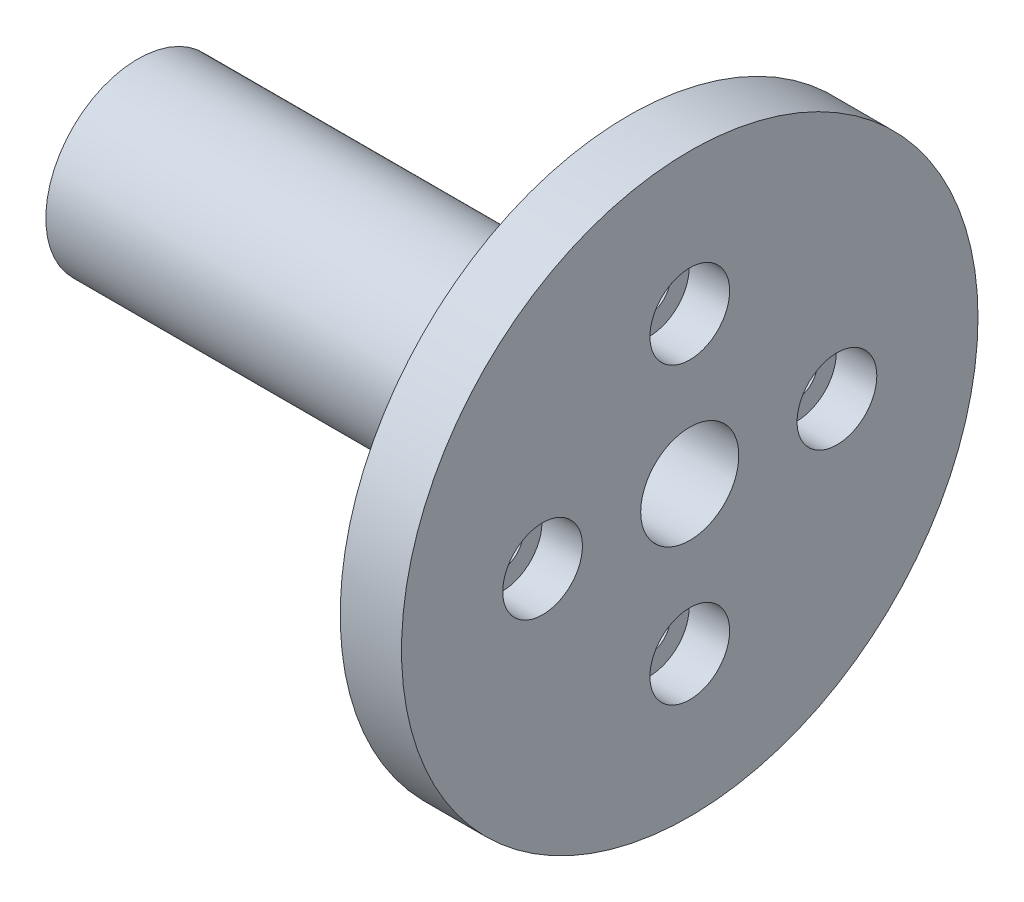
ISO-10303-21;
HEADER;
FILE_DESCRIPTION(('STEP AP214'),'2;1');
FILE_NAME('part.step','',(''),(''),'','','');
FILE_SCHEMA(('AUTOMOTIVE_DESIGN { 1 0 10303 214 1 1 1 1 }'));
ENDSEC;
DATA;
#1=APPLICATION_CONTEXT('core data for automotive mechanical design processes');
#2=APPLICATION_PROTOCOL_DEFINITION('international standard','automotive_design',2000,#1);
#3=PRODUCT_CONTEXT('',#1,'mechanical');
#4=PRODUCT('Part','Part','',(#3));
#5=PRODUCT_RELATED_PRODUCT_CATEGORY('part','',(#4));
#6=PRODUCT_DEFINITION_FORMATION('','',#4);
#7=PRODUCT_DEFINITION_CONTEXT('part definition',#1,'design');
#8=PRODUCT_DEFINITION('design','',#6,#7);
#9=PRODUCT_DEFINITION_SHAPE('','',#8);
#10=(LENGTH_UNIT() NAMED_UNIT(*) SI_UNIT(.MILLI.,.METRE.));
#11=(NAMED_UNIT(*) PLANE_ANGLE_UNIT() SI_UNIT($,.RADIAN.));
#12=(NAMED_UNIT(*) SI_UNIT($,.STERADIAN.) SOLID_ANGLE_UNIT());
#13=UNCERTAINTY_MEASURE_WITH_UNIT(LENGTH_MEASURE(1.E-05),#10,'distance_accuracy_value','');
#14=(GEOMETRIC_REPRESENTATION_CONTEXT(3) GLOBAL_UNCERTAINTY_ASSIGNED_CONTEXT((#13)) GLOBAL_UNIT_ASSIGNED_CONTEXT((#10,
#11,#12)) REPRESENTATION_CONTEXT('',''));
#15=CARTESIAN_POINT('',(0.,0.,0.));
#16=DIRECTION('',(0.,0.,1.));
#17=DIRECTION('',(1.,0.,0.));
#18=AXIS2_PLACEMENT_3D('',#15,#16,#17);
#19=CARTESIAN_POINT('',(0.,0.,-4.5));
#20=DIRECTION('',(-1.,0.,0.));
#21=DIRECTION('',(0.,0.,1.));
#22=AXIS2_PLACEMENT_3D('',#19,#20,#21);
#23=CYLINDRICAL_SURFACE('',#22,1.7);
#24=CARTESIAN_POINT('',(-5.,0.,-4.5));
#25=DIRECTION('',(-1.,0.,0.));
#26=DIRECTION('',(0.,0.,1.));
#27=AXIS2_PLACEMENT_3D('',#24,#25,#26);
#28=CIRCLE('',#27,1.7);
#29=CARTESIAN_POINT('',(-5.,0.,-2.8));
#30=VERTEX_POINT('',#29);
#31=EDGE_CURVE('E62',#30,#30,#28,.T.);
#32=ORIENTED_EDGE('',*,*,#31,.T.);
#33=EDGE_LOOP('',(#32));
#34=FACE_BOUND('',#33,.T.);
#35=CARTESIAN_POINT('',(-3.3,0.,-4.5));
#36=DIRECTION('',(1.,0.,0.));
#37=DIRECTION('',(0.,0.,-1.));
#38=AXIS2_PLACEMENT_3D('',#35,#36,#37);
#39=CIRCLE('',#38,1.7);
#40=CARTESIAN_POINT('',(-3.3,0.,-6.2));
#41=VERTEX_POINT('',#40);
#42=EDGE_CURVE('E38',#41,#41,#39,.F.);
#43=ORIENTED_EDGE('',*,*,#42,.F.);
#44=EDGE_LOOP('',(#43));
#45=FACE_BOUND('',#44,.T.);
#46=ADVANCED_FACE('F34',(#34,#45),#23,.F.);
#47=CARTESIAN_POINT('',(0.,-12.,7.5));
#48=DIRECTION('',(-1.,0.,0.));
#49=DIRECTION('',(0.,0.,1.));
#50=AXIS2_PLACEMENT_3D('',#47,#48,#49);
#51=CYLINDRICAL_SURFACE('',#50,1.7);
#52=CARTESIAN_POINT('',(-5.,-12.,7.5));
#53=DIRECTION('',(-1.,0.,0.));
#54=DIRECTION('',(0.,0.,1.));
#55=AXIS2_PLACEMENT_3D('',#52,#53,#54);
#56=CIRCLE('',#55,1.7);
#57=CARTESIAN_POINT('',(-5.,-12.,9.2));
#58=VERTEX_POINT('',#57);
#59=EDGE_CURVE('E66',#58,#58,#56,.T.);
#60=ORIENTED_EDGE('',*,*,#59,.T.);
#61=EDGE_LOOP('',(#60));
#62=FACE_BOUND('',#61,.T.);
#63=CARTESIAN_POINT('',(-3.3,-12.,7.5));
#64=DIRECTION('',(1.,0.,0.));
#65=DIRECTION('',(0.,0.,-1.));
#66=AXIS2_PLACEMENT_3D('',#63,#64,#65);
#67=CIRCLE('',#66,1.7);
#68=CARTESIAN_POINT('',(-3.3,-12.,5.8));
#69=VERTEX_POINT('',#68);
#70=EDGE_CURVE('E57',#69,#69,#67,.F.);
#71=ORIENTED_EDGE('',*,*,#70,.F.);
#72=EDGE_LOOP('',(#71));
#73=FACE_BOUND('',#72,.T.);
#74=ADVANCED_FACE('F100',(#62,#73),#51,.F.);
#75=CARTESIAN_POINT('',(0.,0.,19.5));
#76=DIRECTION('',(-1.,0.,0.));
#77=DIRECTION('',(0.,0.,1.));
#78=AXIS2_PLACEMENT_3D('',#75,#76,#77);
#79=CYLINDRICAL_SURFACE('',#78,1.7);
#80=CARTESIAN_POINT('',(-5.,0.,19.5));
#81=DIRECTION('',(-1.,0.,0.));
#82=DIRECTION('',(0.,0.,1.));
#83=AXIS2_PLACEMENT_3D('',#80,#81,#82);
#84=CIRCLE('',#83,1.7);
#85=CARTESIAN_POINT('',(-5.,0.,21.2));
#86=VERTEX_POINT('',#85);
#87=EDGE_CURVE('E71',#86,#86,#84,.T.);
#88=ORIENTED_EDGE('',*,*,#87,.T.);
#89=EDGE_LOOP('',(#88));
#90=FACE_BOUND('',#89,.T.);
#91=CARTESIAN_POINT('',(-3.3,0.,19.5));
#92=DIRECTION('',(1.,0.,0.));
#93=DIRECTION('',(0.,0.,-1.));
#94=AXIS2_PLACEMENT_3D('',#91,#92,#93);
#95=CIRCLE('',#94,1.7);
#96=CARTESIAN_POINT('',(-3.3,0.,17.8));
#97=VERTEX_POINT('',#96);
#98=EDGE_CURVE('E54',#97,#97,#95,.F.);
#99=ORIENTED_EDGE('',*,*,#98,.F.);
#100=EDGE_LOOP('',(#99));
#101=FACE_BOUND('',#100,.T.);
#102=ADVANCED_FACE('F105',(#90,#101),#79,.F.);
#103=CARTESIAN_POINT('',(0.,12.,7.5));
#104=DIRECTION('',(-1.,0.,0.));
#105=DIRECTION('',(0.,0.,1.));
#106=AXIS2_PLACEMENT_3D('',#103,#104,#105);
#107=CYLINDRICAL_SURFACE('',#106,1.7);
#108=CARTESIAN_POINT('',(-5.,12.,7.5));
#109=DIRECTION('',(-1.,0.,0.));
#110=DIRECTION('',(0.,0.,1.));
#111=AXIS2_PLACEMENT_3D('',#108,#109,#110);
#112=CIRCLE('',#111,1.7);
#113=CARTESIAN_POINT('',(-5.,12.,9.2));
#114=VERTEX_POINT('',#113);
#115=EDGE_CURVE('E77',#114,#114,#112,.T.);
#116=ORIENTED_EDGE('',*,*,#115,.T.);
#117=EDGE_LOOP('',(#116));
#118=FACE_BOUND('',#117,.T.);
#119=CARTESIAN_POINT('',(-3.3,12.,7.5));
#120=DIRECTION('',(1.,0.,0.));
#121=DIRECTION('',(0.,0.,-1.));
#122=AXIS2_PLACEMENT_3D('',#119,#120,#121);
#123=CIRCLE('',#122,1.7);
#124=CARTESIAN_POINT('',(-3.3,12.,5.8));
#125=VERTEX_POINT('',#124);
#126=EDGE_CURVE('E51',#125,#125,#123,.F.);
#127=ORIENTED_EDGE('',*,*,#126,.F.);
#128=EDGE_LOOP('',(#127));
#129=FACE_BOUND('',#128,.T.);
#130=ADVANCED_FACE('F164',(#118,#129),#107,.F.);
#131=CARTESIAN_POINT('',(-45.,0.,0.));
#132=DIRECTION('',(-1.,0.,0.));
#133=DIRECTION('',(0.,0.,1.));
#134=AXIS2_PLACEMENT_3D('',#131,#132,#133);
#135=PLANE('',#134);
#136=CARTESIAN_POINT('',(-45.,0.,7.50000000000001));
#137=DIRECTION('',(-1.,0.,0.));
#138=DIRECTION('',(0.,0.,1.));
#139=AXIS2_PLACEMENT_3D('',#136,#137,#138);
#140=CIRCLE('',#139,4.);
#141=CARTESIAN_POINT('',(-45.,0.,11.5));
#142=VERTEX_POINT('',#141);
#143=EDGE_CURVE('E147',#142,#142,#140,.T.);
#144=ORIENTED_EDGE('',*,*,#143,.F.);
#145=EDGE_LOOP('',(#144));
#146=FACE_BOUND('',#145,.T.);
#147=CARTESIAN_POINT('',(-45.,0.,7.50000000000001));
#148=DIRECTION('',(1.,0.,0.));
#149=DIRECTION('',(0.,0.,-1.));
#150=AXIS2_PLACEMENT_3D('',#147,#148,#149);
#151=CIRCLE('',#150,7.5);
#152=CARTESIAN_POINT('',(-45.,0.,0.));
#153=VERTEX_POINT('',#152);
#154=EDGE_CURVE('E10',#153,#153,#151,.T.);
#155=ORIENTED_EDGE('',*,*,#154,.F.);
#156=EDGE_LOOP('',(#155));
#157=FACE_BOUND('',#156,.T.);
#158=ADVANCED_FACE('F36',(#146,#157),#135,.T.);
#159=CARTESIAN_POINT('',(0.,0.,7.5));
#160=DIRECTION('',(1.,0.,0.));
#161=DIRECTION('',(0.,0.,-1.));
#162=AXIS2_PLACEMENT_3D('',#159,#160,#161);
#163=CYLINDRICAL_SURFACE('',#162,7.5);
#164=ORIENTED_EDGE('',*,*,#154,.T.);
#165=EDGE_LOOP('',(#164));
#166=FACE_BOUND('',#165,.T.);
#167=CARTESIAN_POINT('',(-5.,0.,7.5));
#168=DIRECTION('',(1.,0.,0.));
#169=DIRECTION('',(0.,0.,-1.));
#170=AXIS2_PLACEMENT_3D('',#167,#168,#169);
#171=CIRCLE('',#170,7.5);
#172=CARTESIAN_POINT('',(-5.,0.,0.));
#173=VERTEX_POINT('',#172);
#174=EDGE_CURVE('E42',#173,#173,#171,.T.);
#175=ORIENTED_EDGE('',*,*,#174,.F.);
#176=EDGE_LOOP('',(#175));
#177=FACE_BOUND('',#176,.T.);
#178=ADVANCED_FACE('F86',(#166,#177),#163,.T.);
#179=CARTESIAN_POINT('',(-5.,0.,-16.));
#180=DIRECTION('',(-1.,0.,0.));
#181=DIRECTION('',(0.,0.,1.));
#182=AXIS2_PLACEMENT_3D('',#179,#180,#181);
#183=PLANE('',#182);
#184=ORIENTED_EDGE('',*,*,#115,.F.);
#185=EDGE_LOOP('',(#184));
#186=FACE_BOUND('',#185,.T.);
#187=ORIENTED_EDGE('',*,*,#87,.F.);
#188=EDGE_LOOP('',(#187));
#189=FACE_BOUND('',#188,.T.);
#190=ORIENTED_EDGE('',*,*,#59,.F.);
#191=EDGE_LOOP('',(#190));
#192=FACE_BOUND('',#191,.T.);
#193=ORIENTED_EDGE('',*,*,#31,.F.);
#194=EDGE_LOOP('',(#193));
#195=FACE_BOUND('',#194,.T.);
#196=ORIENTED_EDGE('',*,*,#174,.T.);
#197=EDGE_LOOP('',(#196));
#198=FACE_BOUND('',#197,.T.);
#199=CARTESIAN_POINT('',(-5.,0.,7.5));
#200=DIRECTION('',(1.,0.,0.));
#201=DIRECTION('',(0.,0.,-1.));
#202=AXIS2_PLACEMENT_3D('',#199,#200,#201);
#203=CIRCLE('',#202,23.5);
#204=CARTESIAN_POINT('',(-5.,0.,-16.));
#205=VERTEX_POINT('',#204);
#206=EDGE_CURVE('E47',#205,#205,#203,.T.);
#207=ORIENTED_EDGE('',*,*,#206,.F.);
#208=EDGE_LOOP('',(#207));
#209=FACE_BOUND('',#208,.T.);
#210=ADVANCED_FACE('F84',(#186,#189,#192,#195,#198,#209),#183,.T.);
#211=CARTESIAN_POINT('',(0.,0.,7.5));
#212=DIRECTION('',(1.,0.,0.));
#213=DIRECTION('',(0.,0.,-1.));
#214=AXIS2_PLACEMENT_3D('',#211,#212,#213);
#215=CYLINDRICAL_SURFACE('',#214,23.5);
#216=ORIENTED_EDGE('',*,*,#206,.T.);
#217=EDGE_LOOP('',(#216));
#218=FACE_BOUND('',#217,.T.);
#219=CARTESIAN_POINT('',(0.,0.,7.5));
#220=DIRECTION('',(1.,0.,0.));
#221=DIRECTION('',(0.,0.,-1.));
#222=AXIS2_PLACEMENT_3D('',#219,#220,#221);
#223=CIRCLE('',#222,23.5);
#224=CARTESIAN_POINT('',(0.,0.,-16.));
#225=VERTEX_POINT('',#224);
#226=EDGE_CURVE('E75',#225,#225,#223,.T.);
#227=ORIENTED_EDGE('',*,*,#226,.F.);
#228=EDGE_LOOP('',(#227));
#229=FACE_BOUND('',#228,.T.);
#230=ADVANCED_FACE('F81',(#218,#229),#215,.T.);
#231=CARTESIAN_POINT('',(0.,0.,0.));
#232=DIRECTION('',(1.,0.,0.));
#233=DIRECTION('',(0.,0.,-1.));
#234=AXIS2_PLACEMENT_3D('',#231,#232,#233);
#235=PLANE('',#234);
#236=CARTESIAN_POINT('',(0.,0.,7.5));
#237=DIRECTION('',(-1.,0.,0.));
#238=DIRECTION('',(0.,0.,1.));
#239=AXIS2_PLACEMENT_3D('',#236,#237,#238);
#240=CIRCLE('',#239,4.);
#241=CARTESIAN_POINT('',(0.,0.,11.5));
#242=VERTEX_POINT('',#241);
#243=EDGE_CURVE('E124',#242,#242,#240,.T.);
#244=ORIENTED_EDGE('',*,*,#243,.T.);
#245=EDGE_LOOP('',(#244));
#246=FACE_BOUND('',#245,.T.);
#247=CARTESIAN_POINT('',(0.,12.,7.5));
#248=DIRECTION('',(1.,0.,0.));
#249=DIRECTION('',(0.,0.,-1.));
#250=AXIS2_PLACEMENT_3D('',#247,#248,#249);
#251=CIRCLE('',#250,3.25);
#252=CARTESIAN_POINT('',(0.,12.,4.25));
#253=VERTEX_POINT('',#252);
#254=EDGE_CURVE('E128',#253,#253,#251,.T.);
#255=ORIENTED_EDGE('',*,*,#254,.F.);
#256=EDGE_LOOP('',(#255));
#257=FACE_BOUND('',#256,.T.);
#258=CARTESIAN_POINT('',(0.,0.,19.5));
#259=DIRECTION('',(1.,0.,0.));
#260=DIRECTION('',(0.,0.,-1.));
#261=AXIS2_PLACEMENT_3D('',#258,#259,#260);
#262=CIRCLE('',#261,3.25);
#263=CARTESIAN_POINT('',(0.,0.,16.25));
#264=VERTEX_POINT('',#263);
#265=EDGE_CURVE('E132',#264,#264,#262,.T.);
#266=ORIENTED_EDGE('',*,*,#265,.F.);
#267=EDGE_LOOP('',(#266));
#268=FACE_BOUND('',#267,.T.);
#269=CARTESIAN_POINT('',(0.,0.,-4.5));
#270=DIRECTION('',(1.,0.,0.));
#271=DIRECTION('',(0.,0.,-1.));
#272=AXIS2_PLACEMENT_3D('',#269,#270,#271);
#273=CIRCLE('',#272,3.25);
#274=CARTESIAN_POINT('',(0.,0.,-7.75));
#275=VERTEX_POINT('',#274);
#276=EDGE_CURVE('E136',#275,#275,#273,.T.);
#277=ORIENTED_EDGE('',*,*,#276,.F.);
#278=EDGE_LOOP('',(#277));
#279=FACE_BOUND('',#278,.T.);
#280=CARTESIAN_POINT('',(0.,-12.,7.5));
#281=DIRECTION('',(1.,0.,0.));
#282=DIRECTION('',(0.,0.,-1.));
#283=AXIS2_PLACEMENT_3D('',#280,#281,#282);
#284=CIRCLE('',#283,3.25);
#285=CARTESIAN_POINT('',(0.,-12.,4.25));
#286=VERTEX_POINT('',#285);
#287=EDGE_CURVE('E140',#286,#286,#284,.T.);
#288=ORIENTED_EDGE('',*,*,#287,.F.);
#289=EDGE_LOOP('',(#288));
#290=FACE_BOUND('',#289,.T.);
#291=ORIENTED_EDGE('',*,*,#226,.T.);
#292=EDGE_LOOP('',(#291));
#293=FACE_BOUND('',#292,.T.);
#294=ADVANCED_FACE('F94',(#246,#257,#268,#279,#290,#293),#235,.T.);
#295=CARTESIAN_POINT('',(-3.3,12.,7.5));
#296=DIRECTION('',(1.,0.,0.));
#297=DIRECTION('',(0.,0.,-1.));
#298=AXIS2_PLACEMENT_3D('',#295,#296,#297);
#299=PLANE('',#298);
#300=CARTESIAN_POINT('',(-3.3,12.,7.5));
#301=DIRECTION('',(1.,0.,0.));
#302=DIRECTION('',(0.,0.,-1.));
#303=AXIS2_PLACEMENT_3D('',#300,#301,#302);
#304=CIRCLE('',#303,3.25);
#305=CARTESIAN_POINT('',(-3.3,12.,4.25));
#306=VERTEX_POINT('',#305);
#307=EDGE_CURVE('E55',#306,#306,#304,.T.);
#308=ORIENTED_EDGE('',*,*,#307,.T.);
#309=EDGE_LOOP('',(#308));
#310=FACE_BOUND('',#309,.T.);
#311=ORIENTED_EDGE('',*,*,#126,.T.);
#312=EDGE_LOOP('',(#311));
#313=FACE_BOUND('',#312,.T.);
#314=ADVANCED_FACE('F112',(#310,#313),#299,.T.);
#315=CARTESIAN_POINT('',(-3.3,12.,7.5));
#316=DIRECTION('',(1.,0.,0.));
#317=DIRECTION('',(0.,0.,-1.));
#318=AXIS2_PLACEMENT_3D('',#315,#316,#317);
#319=CYLINDRICAL_SURFACE('',#318,3.25);
#320=ORIENTED_EDGE('',*,*,#307,.F.);
#321=EDGE_LOOP('',(#320));
#322=FACE_BOUND('',#321,.T.);
#323=ORIENTED_EDGE('',*,*,#254,.T.);
#324=EDGE_LOOP('',(#323));
#325=FACE_BOUND('',#324,.T.);
#326=ADVANCED_FACE('F118',(#322,#325),#319,.F.);
#327=CARTESIAN_POINT('',(-3.3,0.,19.5));
#328=DIRECTION('',(1.,0.,0.));
#329=DIRECTION('',(0.,0.,-1.));
#330=AXIS2_PLACEMENT_3D('',#327,#328,#329);
#331=PLANE('',#330);
#332=CARTESIAN_POINT('',(-3.3,0.,19.5));
#333=DIRECTION('',(1.,0.,0.));
#334=DIRECTION('',(0.,0.,-1.));
#335=AXIS2_PLACEMENT_3D('',#332,#333,#334);
#336=CIRCLE('',#335,3.25);
#337=CARTESIAN_POINT('',(-3.3,0.,16.25));
#338=VERTEX_POINT('',#337);
#339=EDGE_CURVE('E219',#338,#338,#336,.T.);
#340=ORIENTED_EDGE('',*,*,#339,.T.);
#341=EDGE_LOOP('',(#340));
#342=FACE_BOUND('',#341,.T.);
#343=ORIENTED_EDGE('',*,*,#98,.T.);
#344=EDGE_LOOP('',(#343));
#345=FACE_BOUND('',#344,.T.);
#346=ADVANCED_FACE('F167',(#342,#345),#331,.T.);
#347=CARTESIAN_POINT('',(-3.3,0.,19.5));
#348=DIRECTION('',(1.,0.,0.));
#349=DIRECTION('',(0.,0.,-1.));
#350=AXIS2_PLACEMENT_3D('',#347,#348,#349);
#351=CYLINDRICAL_SURFACE('',#350,3.25);
#352=ORIENTED_EDGE('',*,*,#339,.F.);
#353=EDGE_LOOP('',(#352));
#354=FACE_BOUND('',#353,.T.);
#355=ORIENTED_EDGE('',*,*,#265,.T.);
#356=EDGE_LOOP('',(#355));
#357=FACE_BOUND('',#356,.T.);
#358=ADVANCED_FACE('F169',(#354,#357),#351,.F.);
#359=CARTESIAN_POINT('',(-3.3,-12.,7.5));
#360=DIRECTION('',(1.,0.,0.));
#361=DIRECTION('',(0.,0.,-1.));
#362=AXIS2_PLACEMENT_3D('',#359,#360,#361);
#363=PLANE('',#362);
#364=CARTESIAN_POINT('',(-3.3,-12.,7.5));
#365=DIRECTION('',(1.,0.,0.));
#366=DIRECTION('',(0.,0.,-1.));
#367=AXIS2_PLACEMENT_3D('',#364,#365,#366);
#368=CIRCLE('',#367,3.25);
#369=CARTESIAN_POINT('',(-3.3,-12.,4.25));
#370=VERTEX_POINT('',#369);
#371=EDGE_CURVE('E143',#370,#370,#368,.T.);
#372=ORIENTED_EDGE('',*,*,#371,.T.);
#373=EDGE_LOOP('',(#372));
#374=FACE_BOUND('',#373,.T.);
#375=ORIENTED_EDGE('',*,*,#70,.T.);
#376=EDGE_LOOP('',(#375));
#377=FACE_BOUND('',#376,.T.);
#378=ADVANCED_FACE('F176',(#374,#377),#363,.T.);
#379=CARTESIAN_POINT('',(-3.3,-12.,7.5));
#380=DIRECTION('',(1.,0.,0.));
#381=DIRECTION('',(0.,0.,-1.));
#382=AXIS2_PLACEMENT_3D('',#379,#380,#381);
#383=CYLINDRICAL_SURFACE('',#382,3.25);
#384=ORIENTED_EDGE('',*,*,#371,.F.);
#385=EDGE_LOOP('',(#384));
#386=FACE_BOUND('',#385,.T.);
#387=ORIENTED_EDGE('',*,*,#287,.T.);
#388=EDGE_LOOP('',(#387));
#389=FACE_BOUND('',#388,.T.);
#390=ADVANCED_FACE('F187',(#386,#389),#383,.F.);
#391=CARTESIAN_POINT('',(-3.3,0.,-4.5));
#392=DIRECTION('',(1.,0.,0.));
#393=DIRECTION('',(0.,0.,-1.));
#394=AXIS2_PLACEMENT_3D('',#391,#392,#393);
#395=PLANE('',#394);
#396=CARTESIAN_POINT('',(-3.3,0.,-4.5));
#397=DIRECTION('',(1.,0.,0.));
#398=DIRECTION('',(0.,0.,-1.));
#399=AXIS2_PLACEMENT_3D('',#396,#397,#398);
#400=CIRCLE('',#399,3.25);
#401=CARTESIAN_POINT('',(-3.3,0.,-7.75));
#402=VERTEX_POINT('',#401);
#403=EDGE_CURVE('E222',#402,#402,#400,.T.);
#404=ORIENTED_EDGE('',*,*,#403,.T.);
#405=EDGE_LOOP('',(#404));
#406=FACE_BOUND('',#405,.T.);
#407=ORIENTED_EDGE('',*,*,#42,.T.);
#408=EDGE_LOOP('',(#407));
#409=FACE_BOUND('',#408,.T.);
#410=ADVANCED_FACE('F183',(#406,#409),#395,.T.);
#411=CARTESIAN_POINT('',(-3.3,0.,-4.5));
#412=DIRECTION('',(1.,0.,0.));
#413=DIRECTION('',(0.,0.,-1.));
#414=AXIS2_PLACEMENT_3D('',#411,#412,#413);
#415=CYLINDRICAL_SURFACE('',#414,3.25);
#416=ORIENTED_EDGE('',*,*,#403,.F.);
#417=EDGE_LOOP('',(#416));
#418=FACE_BOUND('',#417,.T.);
#419=ORIENTED_EDGE('',*,*,#276,.T.);
#420=EDGE_LOOP('',(#419));
#421=FACE_BOUND('',#420,.T.);
#422=ADVANCED_FACE('F186',(#418,#421),#415,.F.);
#423=CARTESIAN_POINT('',(0.,0.,7.5));
#424=DIRECTION('',(-1.,0.,0.));
#425=DIRECTION('',(0.,0.,1.));
#426=AXIS2_PLACEMENT_3D('',#423,#424,#425);
#427=CYLINDRICAL_SURFACE('',#426,4.);
#428=ORIENTED_EDGE('',*,*,#243,.F.);
#429=EDGE_LOOP('',(#428));
#430=FACE_BOUND('',#429,.T.);
#431=ORIENTED_EDGE('',*,*,#143,.T.);
#432=EDGE_LOOP('',(#431));
#433=FACE_BOUND('',#432,.T.);
#434=ADVANCED_FACE('F191',(#430,#433),#427,.F.);
#435=CLOSED_SHELL('',(#46,#74,#102,#130,#158,#178,#210,#230,#294,#314,#326,#346,#358,#378,#390,
#410,#422,#434));
#436=MANIFOLD_SOLID_BREP('B2',#435);
#437=ADVANCED_BREP_SHAPE_REPRESENTATION('',(#18,#436),#14);
#438=SHAPE_DEFINITION_REPRESENTATION(#9,#437);
ENDSEC;
END-ISO-10303-21;
